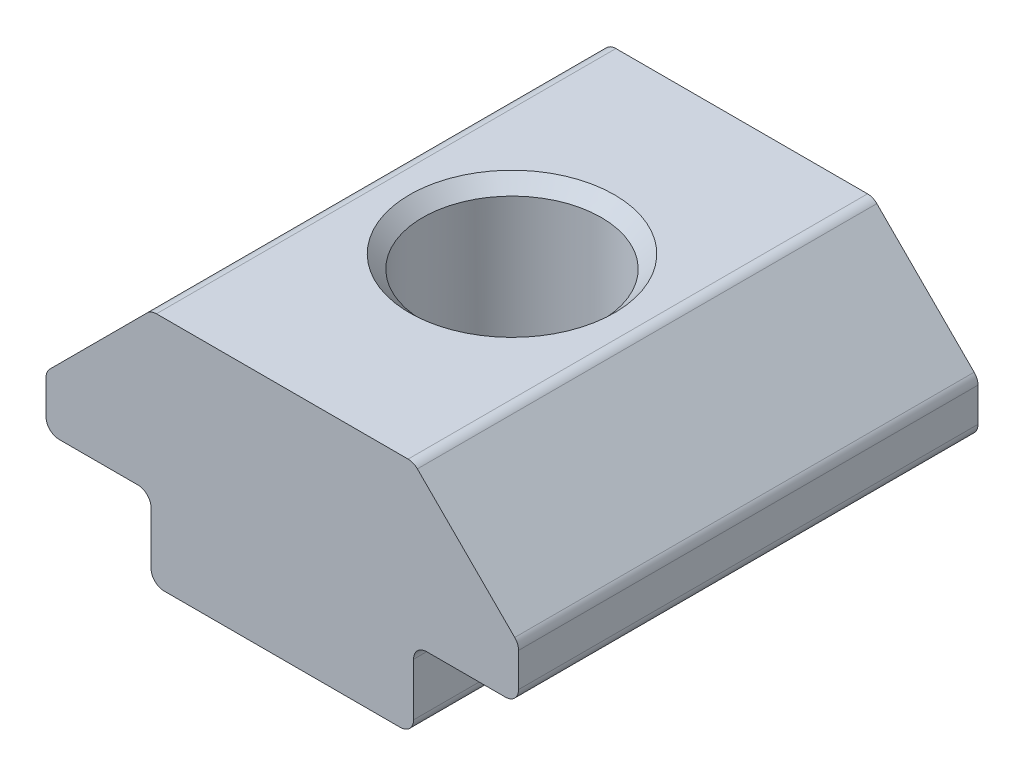
ISO-10303-21;
HEADER;
FILE_DESCRIPTION(('STEP AP214'),'2;1');
FILE_NAME('part.step','',(''),(''),'','','');
FILE_SCHEMA(('AUTOMOTIVE_DESIGN { 1 0 10303 214 1 1 1 1 }'));
ENDSEC;
DATA;
#1=APPLICATION_CONTEXT('core data for automotive mechanical design processes');
#2=APPLICATION_PROTOCOL_DEFINITION('international standard','automotive_design',2000,#1);
#3=PRODUCT_CONTEXT('',#1,'mechanical');
#4=PRODUCT('Part','Part','',(#3));
#5=PRODUCT_RELATED_PRODUCT_CATEGORY('part','',(#4));
#6=PRODUCT_DEFINITION_FORMATION('','',#4);
#7=PRODUCT_DEFINITION_CONTEXT('part definition',#1,'design');
#8=PRODUCT_DEFINITION('design','',#6,#7);
#9=PRODUCT_DEFINITION_SHAPE('','',#8);
#10=(LENGTH_UNIT() NAMED_UNIT(*) SI_UNIT(.MILLI.,.METRE.));
#11=(NAMED_UNIT(*) PLANE_ANGLE_UNIT() SI_UNIT($,.RADIAN.));
#12=(NAMED_UNIT(*) SI_UNIT($,.STERADIAN.) SOLID_ANGLE_UNIT());
#13=UNCERTAINTY_MEASURE_WITH_UNIT(LENGTH_MEASURE(1.E-05),#10,'distance_accuracy_value','');
#14=(GEOMETRIC_REPRESENTATION_CONTEXT(3) GLOBAL_UNCERTAINTY_ASSIGNED_CONTEXT((#13)) GLOBAL_UNIT_ASSIGNED_CONTEXT((#10,
#11,#12)) REPRESENTATION_CONTEXT('',''));
#15=CARTESIAN_POINT('',(0.,0.,0.));
#16=DIRECTION('',(0.,0.,1.));
#17=DIRECTION('',(1.,0.,0.));
#18=AXIS2_PLACEMENT_3D('',#15,#16,#17);
#19=CARTESIAN_POINT('',(-6.70675625884087,1.22965119205537,7.72754867549793));
#20=DIRECTION('',(1.,0.,0.));
#21=DIRECTION('',(0.,0.,-1.));
#22=AXIS2_PLACEMENT_3D('',#19,#20,#21);
#23=PLANE('',#22);
#24=DIRECTION('',(0.,-1.,0.));
#25=VECTOR('',#24,1.);
#26=CARTESIAN_POINT('',(-6.70675625884087,1.22965119205537,7.72754867549793));
#27=LINE('',#26,#25);
#28=CARTESIAN_POINT('',(-6.70675625884087,0.729651192055372,7.72754867549793));
#29=VERTEX_POINT('',#28);
#30=CARTESIAN_POINT('',(-6.70675625884087,-1.27034880794463,7.72754867549793));
#31=VERTEX_POINT('',#30);
#32=EDGE_CURVE('E204',#29,#31,#27,.T.);
#33=ORIENTED_EDGE('',*,*,#32,.F.);
#34=DIRECTION('',(0.,0.,-1.));
#35=VECTOR('',#34,1.);
#36=CARTESIAN_POINT('',(-6.70675625884087,0.729651192055372,-9.77245132450207));
#37=LINE('',#36,#35);
#38=CARTESIAN_POINT('',(-6.70675625884087,0.729651192055372,-9.77245132450207));
#39=VERTEX_POINT('',#38);
#40=EDGE_CURVE('E288',#29,#39,#37,.T.);
#41=ORIENTED_EDGE('',*,*,#40,.T.);
#42=DIRECTION('',(0.,-1.,0.));
#43=VECTOR('',#42,1.);
#44=CARTESIAN_POINT('',(-6.70675625884087,1.22965119205537,-9.77245132450207));
#45=LINE('',#44,#43);
#46=CARTESIAN_POINT('',(-6.70675625884087,-1.27034880794463,-9.77245132450207));
#47=VERTEX_POINT('',#46);
#48=EDGE_CURVE('E178',#39,#47,#45,.T.);
#49=ORIENTED_EDGE('',*,*,#48,.T.);
#50=DIRECTION('',(0.,0.,-1.));
#51=VECTOR('',#50,1.);
#52=CARTESIAN_POINT('',(-6.70675625884087,-1.27034880794463,7.72754867549793));
#53=LINE('',#52,#51);
#54=EDGE_CURVE('E160',#47,#31,#53,.F.);
#55=ORIENTED_EDGE('',*,*,#54,.T.);
#56=EDGE_LOOP('',(#33,#41,#49,#55));
#57=FACE_BOUND('',#56,.T.);
#58=ADVANCED_FACE('F16',(#57),#23,.F.);
#59=CARTESIAN_POINT('',(-6.70675625884087,-1.77034880794463,7.72754867549793));
#60=DIRECTION('',(0.,1.,0.));
#61=DIRECTION('',(0.,0.,1.));
#62=AXIS2_PLACEMENT_3D('',#59,#60,#61);
#63=PLANE('',#62);
#64=CARTESIAN_POINT('',(-1.70675625884087,-1.77034880794463,-1.02245132450207));
#65=DIRECTION('',(0.,1.,0.));
#66=DIRECTION('',(0.,0.,1.));
#67=AXIS2_PLACEMENT_3D('',#64,#65,#66);
#68=CIRCLE('',#67,3.9);
#69=CARTESIAN_POINT('',(-1.70675625884087,-1.77034880794463,2.87754867549793));
#70=VERTEX_POINT('',#69);
#71=EDGE_CURVE('E271',#70,#70,#68,.T.);
#72=ORIENTED_EDGE('',*,*,#71,.T.);
#73=EDGE_LOOP('',(#72));
#74=FACE_BOUND('',#73,.T.);
#75=DIRECTION('',(1.,0.,0.));
#76=VECTOR('',#75,1.);
#77=CARTESIAN_POINT('',(-6.70675625884087,-1.77034880794463,7.72754867549793));
#78=LINE('',#77,#76);
#79=CARTESIAN_POINT('',(-6.20675625884087,-1.77034880794463,7.72754867549793));
#80=VERTEX_POINT('',#79);
#81=CARTESIAN_POINT('',(2.79324374115913,-1.77034880794463,7.72754867549793));
#82=VERTEX_POINT('',#81);
#83=EDGE_CURVE('E171',#80,#82,#78,.T.);
#84=ORIENTED_EDGE('',*,*,#83,.F.);
#85=DIRECTION('',(0.,0.,-1.));
#86=VECTOR('',#85,1.);
#87=CARTESIAN_POINT('',(-6.20675625884087,-1.77034880794463,7.72754867549793));
#88=LINE('',#87,#86);
#89=CARTESIAN_POINT('',(-6.20675625884087,-1.77034880794463,-9.77245132450207));
#90=VERTEX_POINT('',#89);
#91=EDGE_CURVE('E158',#80,#90,#88,.T.);
#92=ORIENTED_EDGE('',*,*,#91,.T.);
#93=DIRECTION('',(1.,0.,0.));
#94=VECTOR('',#93,1.);
#95=CARTESIAN_POINT('',(-6.70675625884087,-1.77034880794463,-9.77245132450207));
#96=LINE('',#95,#94);
#97=CARTESIAN_POINT('',(2.79324374115913,-1.77034880794463,-9.77245132450207));
#98=VERTEX_POINT('',#97);
#99=EDGE_CURVE('E168',#90,#98,#96,.T.);
#100=ORIENTED_EDGE('',*,*,#99,.T.);
#101=DIRECTION('',(0.,0.,-1.));
#102=VECTOR('',#101,1.);
#103=CARTESIAN_POINT('',(2.79324374115913,-1.77034880794463,7.72754867549793));
#104=LINE('',#103,#102);
#105=EDGE_CURVE('E173',#98,#82,#104,.F.);
#106=ORIENTED_EDGE('',*,*,#105,.T.);
#107=EDGE_LOOP('',(#84,#92,#100,#106));
#108=FACE_BOUND('',#107,.T.);
#109=ADVANCED_FACE('F167',(#74,#108),#63,.F.);
#110=CARTESIAN_POINT('',(3.29324374115913,-1.77034880794463,7.72754867549793));
#111=DIRECTION('',(-1.,0.,0.));
#112=DIRECTION('',(0.,0.,1.));
#113=AXIS2_PLACEMENT_3D('',#110,#111,#112);
#114=PLANE('',#113);
#115=DIRECTION('',(0.,1.,0.));
#116=VECTOR('',#115,1.);
#117=CARTESIAN_POINT('',(3.29324374115913,-1.77034880794463,-9.77245132450207));
#118=LINE('',#117,#116);
#119=CARTESIAN_POINT('',(3.29324374115913,-1.27034880794463,-9.77245132450207));
#120=VERTEX_POINT('',#119);
#121=CARTESIAN_POINT('',(3.29324374115913,0.729651192055372,-9.77245132450207));
#122=VERTEX_POINT('',#121);
#123=EDGE_CURVE('E177',#120,#122,#118,.T.);
#124=ORIENTED_EDGE('',*,*,#123,.T.);
#125=DIRECTION('',(0.,0.,-1.));
#126=VECTOR('',#125,1.);
#127=CARTESIAN_POINT('',(3.29324374115913,0.729651192055372,7.72754867549793));
#128=LINE('',#127,#126);
#129=CARTESIAN_POINT('',(3.29324374115913,0.729651192055372,7.72754867549793));
#130=VERTEX_POINT('',#129);
#131=EDGE_CURVE('E286',#122,#130,#128,.F.);
#132=ORIENTED_EDGE('',*,*,#131,.T.);
#133=DIRECTION('',(0.,1.,0.));
#134=VECTOR('',#133,1.);
#135=CARTESIAN_POINT('',(3.29324374115913,-1.77034880794463,7.72754867549793));
#136=LINE('',#135,#134);
#137=CARTESIAN_POINT('',(3.29324374115913,-1.27034880794463,7.72754867549793));
#138=VERTEX_POINT('',#137);
#139=EDGE_CURVE('E302',#138,#130,#136,.T.);
#140=ORIENTED_EDGE('',*,*,#139,.F.);
#141=DIRECTION('',(0.,0.,-1.));
#142=VECTOR('',#141,1.);
#143=CARTESIAN_POINT('',(3.29324374115913,-1.27034880794463,7.72754867549793));
#144=LINE('',#143,#142);
#145=EDGE_CURVE('E268',#138,#120,#144,.T.);
#146=ORIENTED_EDGE('',*,*,#145,.T.);
#147=EDGE_LOOP('',(#124,#132,#140,#146));
#148=FACE_BOUND('',#147,.T.);
#149=ADVANCED_FACE('F315',(#148),#114,.F.);
#150=CARTESIAN_POINT('',(3.29324374115913,1.22965119205537,7.72754867549793));
#151=DIRECTION('',(0.,1.,0.));
#152=DIRECTION('',(0.,0.,1.));
#153=AXIS2_PLACEMENT_3D('',#150,#151,#152);
#154=PLANE('',#153);
#155=DIRECTION('',(1.,0.,0.));
#156=VECTOR('',#155,1.);
#157=CARTESIAN_POINT('',(3.29324374115913,1.22965119205537,7.72754867549793));
#158=LINE('',#157,#156);
#159=CARTESIAN_POINT('',(3.79324374115913,1.22965119205537,7.72754867549793));
#160=VERTEX_POINT('',#159);
#161=CARTESIAN_POINT('',(6.79324374115913,1.22965119205537,7.72754867549793));
#162=VERTEX_POINT('',#161);
#163=EDGE_CURVE('E300',#160,#162,#158,.T.);
#164=ORIENTED_EDGE('',*,*,#163,.F.);
#165=DIRECTION('',(0.,0.,-1.));
#166=VECTOR('',#165,1.);
#167=CARTESIAN_POINT('',(3.79324374115913,1.22965119205537,-9.77245132450207));
#168=LINE('',#167,#166);
#169=CARTESIAN_POINT('',(3.79324374115913,1.22965119205537,-9.77245132450207));
#170=VERTEX_POINT('',#169);
#171=EDGE_CURVE('E283',#160,#170,#168,.T.);
#172=ORIENTED_EDGE('',*,*,#171,.T.);
#173=DIRECTION('',(1.,0.,0.));
#174=VECTOR('',#173,1.);
#175=CARTESIAN_POINT('',(3.29324374115913,1.22965119205537,-9.77245132450207));
#176=LINE('',#175,#174);
#177=CARTESIAN_POINT('',(6.79324374115913,1.22965119205537,-9.77245132450207));
#178=VERTEX_POINT('',#177);
#179=EDGE_CURVE('E181',#170,#178,#176,.T.);
#180=ORIENTED_EDGE('',*,*,#179,.T.);
#181=DIRECTION('',(0.,0.,-1.));
#182=VECTOR('',#181,1.);
#183=CARTESIAN_POINT('',(6.79324374115913,1.22965119205537,7.72754867549793));
#184=LINE('',#183,#182);
#185=EDGE_CURVE('E265',#178,#162,#184,.F.);
#186=ORIENTED_EDGE('',*,*,#185,.T.);
#187=EDGE_LOOP('',(#164,#172,#180,#186));
#188=FACE_BOUND('',#187,.T.);
#189=ADVANCED_FACE('F307',(#188),#154,.F.);
#190=CARTESIAN_POINT('',(7.29324374115913,1.22965119205537,7.72754867549793));
#191=DIRECTION('',(-1.,0.,0.));
#192=DIRECTION('',(0.,0.,1.));
#193=AXIS2_PLACEMENT_3D('',#190,#191,#192);
#194=PLANE('',#193);
#195=DIRECTION('',(0.,1.,0.));
#196=VECTOR('',#195,1.);
#197=CARTESIAN_POINT('',(7.29324374115913,1.22965119205537,-9.77245132450207));
#198=LINE('',#197,#196);
#199=CARTESIAN_POINT('',(7.29324374115913,1.72965119205537,-9.77245132450207));
#200=VERTEX_POINT('',#199);
#201=CARTESIAN_POINT('',(7.29324374115913,3.02254441086884,-9.77245132450207));
#202=VERTEX_POINT('',#201);
#203=EDGE_CURVE('E187',#200,#202,#198,.T.);
#204=ORIENTED_EDGE('',*,*,#203,.T.);
#205=DIRECTION('',(0.,0.,-1.));
#206=VECTOR('',#205,1.);
#207=CARTESIAN_POINT('',(7.29324374115913,3.02254441086884,7.72754867549793));
#208=LINE('',#207,#206);
#209=CARTESIAN_POINT('',(7.29324374115913,3.02254441086884,7.72754867549793));
#210=VERTEX_POINT('',#209);
#211=EDGE_CURVE('E263',#202,#210,#208,.F.);
#212=ORIENTED_EDGE('',*,*,#211,.T.);
#213=DIRECTION('',(0.,1.,0.));
#214=VECTOR('',#213,1.);
#215=CARTESIAN_POINT('',(7.29324374115913,1.22965119205537,7.72754867549793));
#216=LINE('',#215,#214);
#217=CARTESIAN_POINT('',(7.29324374115913,1.72965119205537,7.72754867549793));
#218=VERTEX_POINT('',#217);
#219=EDGE_CURVE('E311',#218,#210,#216,.T.);
#220=ORIENTED_EDGE('',*,*,#219,.F.);
#221=DIRECTION('',(0.,0.,-1.));
#222=VECTOR('',#221,1.);
#223=CARTESIAN_POINT('',(7.29324374115913,1.72965119205537,7.72754867549793));
#224=LINE('',#223,#222);
#225=EDGE_CURVE('E260',#218,#200,#224,.T.);
#226=ORIENTED_EDGE('',*,*,#225,.T.);
#227=EDGE_LOOP('',(#204,#212,#220,#226));
#228=FACE_BOUND('',#227,.T.);
#229=ADVANCED_FACE('F541',(#228),#194,.F.);
#230=CARTESIAN_POINT('',(7.29324374115913,3.22965119205539,7.72754867549793));
#231=DIRECTION('',(-0.707106781186546,-0.707106781186549,0.));
#232=DIRECTION('',(0.707106781186549,-0.707106781186546,0.));
#233=AXIS2_PLACEMENT_3D('',#230,#231,#232);
#234=PLANE('',#233);
#235=DIRECTION('',(-0.707106781186549,0.707106781186546,0.));
#236=VECTOR('',#235,1.);
#237=CARTESIAN_POINT('',(7.29324374115913,3.22965119205539,-9.77245132450207));
#238=LINE('',#237,#236);
#239=CARTESIAN_POINT('',(7.1467971317524,3.37609780146211,-9.77245132450207));
#240=VERTEX_POINT('',#239);
#241=CARTESIAN_POINT('',(3.43969035056586,7.08320458264865,-9.77245132450207));
#242=VERTEX_POINT('',#241);
#243=EDGE_CURVE('E190',#240,#242,#238,.T.);
#244=ORIENTED_EDGE('',*,*,#243,.T.);
#245=DIRECTION('',(0.,0.,-1.));
#246=VECTOR('',#245,1.);
#247=CARTESIAN_POINT('',(3.43969035056586,7.08320458264864,7.72754867549793));
#248=LINE('',#247,#246);
#249=CARTESIAN_POINT('',(3.43969035056586,7.08320458264865,7.72754867549793));
#250=VERTEX_POINT('',#249);
#251=EDGE_CURVE('E258',#242,#250,#248,.F.);
#252=ORIENTED_EDGE('',*,*,#251,.T.);
#253=DIRECTION('',(-0.707106781186549,0.707106781186546,0.));
#254=VECTOR('',#253,1.);
#255=CARTESIAN_POINT('',(7.29324374115913,3.22965119205539,7.72754867549793));
#256=LINE('',#255,#254);
#257=CARTESIAN_POINT('',(7.1467971317524,3.37609780146211,7.72754867549793));
#258=VERTEX_POINT('',#257);
#259=EDGE_CURVE('E326',#258,#250,#256,.T.);
#260=ORIENTED_EDGE('',*,*,#259,.F.);
#261=DIRECTION('',(0.,0.,-1.));
#262=VECTOR('',#261,1.);
#263=CARTESIAN_POINT('',(7.1467971317524,3.37609780146211,7.72754867549793));
#264=LINE('',#263,#262);
#265=EDGE_CURVE('E255',#258,#240,#264,.T.);
#266=ORIENTED_EDGE('',*,*,#265,.T.);
#267=EDGE_LOOP('',(#244,#252,#260,#266));
#268=FACE_BOUND('',#267,.T.);
#269=ADVANCED_FACE('F531',(#268),#234,.F.);
#270=CARTESIAN_POINT('',(3.29324374115913,7.22965119205537,7.72754867549793));
#271=DIRECTION('',(0.,-1.,0.));
#272=DIRECTION('',(0.,0.,-1.));
#273=AXIS2_PLACEMENT_3D('',#270,#271,#272);
#274=PLANE('',#273);
#275=CARTESIAN_POINT('',(-1.70675625884087,7.22965119205537,-1.02245132450207));
#276=DIRECTION('',(0.,-1.,0.));
#277=DIRECTION('',(0.,0.,-1.));
#278=AXIS2_PLACEMENT_3D('',#275,#276,#277);
#279=CIRCLE('',#278,3.90000000000001);
#280=CARTESIAN_POINT('',(-1.70675625884087,7.22965119205537,-4.92245132450208));
#281=VERTEX_POINT('',#280);
#282=EDGE_CURVE('E280',#281,#281,#279,.T.);
#283=ORIENTED_EDGE('',*,*,#282,.T.);
#284=EDGE_LOOP('',(#283));
#285=FACE_BOUND('',#284,.T.);
#286=DIRECTION('',(-1.,0.,0.));
#287=VECTOR('',#286,1.);
#288=CARTESIAN_POINT('',(3.29324374115913,7.22965119205537,-9.77245132450207));
#289=LINE('',#288,#287);
#290=CARTESIAN_POINT('',(3.08613695997259,7.22965119205537,-9.77245132450207));
#291=VERTEX_POINT('',#290);
#292=CARTESIAN_POINT('',(-6.49964947765432,7.22965119205537,-9.77245132450207));
#293=VERTEX_POINT('',#292);
#294=EDGE_CURVE('E193',#291,#293,#289,.T.);
#295=ORIENTED_EDGE('',*,*,#294,.T.);
#296=DIRECTION('',(0.,0.,-1.));
#297=VECTOR('',#296,1.);
#298=CARTESIAN_POINT('',(-6.49964947765432,7.22965119205537,7.72754867549793));
#299=LINE('',#298,#297);
#300=CARTESIAN_POINT('',(-6.49964947765432,7.22965119205537,7.72754867549793));
#301=VERTEX_POINT('',#300);
#302=EDGE_CURVE('E253',#293,#301,#299,.F.);
#303=ORIENTED_EDGE('',*,*,#302,.T.);
#304=DIRECTION('',(-1.,0.,0.));
#305=VECTOR('',#304,1.);
#306=CARTESIAN_POINT('',(3.29324374115913,7.22965119205537,7.72754867549793));
#307=LINE('',#306,#305);
#308=CARTESIAN_POINT('',(3.08613695997259,7.22965119205537,7.72754867549793));
#309=VERTEX_POINT('',#308);
#310=EDGE_CURVE('E329',#309,#301,#307,.T.);
#311=ORIENTED_EDGE('',*,*,#310,.F.);
#312=DIRECTION('',(0.,0.,-1.));
#313=VECTOR('',#312,1.);
#314=CARTESIAN_POINT('',(3.08613695997259,7.22965119205537,7.72754867549793));
#315=LINE('',#314,#313);
#316=EDGE_CURVE('E250',#309,#291,#315,.T.);
#317=ORIENTED_EDGE('',*,*,#316,.T.);
#318=EDGE_LOOP('',(#295,#303,#311,#317));
#319=FACE_BOUND('',#318,.T.);
#320=ADVANCED_FACE('F521',(#285,#319),#274,.F.);
#321=CARTESIAN_POINT('',(-10.7067562588409,3.22965119205538,7.72754867549793));
#322=DIRECTION('',(0.707106781186546,-0.707106781186549,0.));
#323=DIRECTION('',(0.707106781186549,0.707106781186546,0.));
#324=AXIS2_PLACEMENT_3D('',#321,#322,#323);
#325=PLANE('',#324);
#326=DIRECTION('',(-0.707106781186549,-0.707106781186546,0.));
#327=VECTOR('',#326,1.);
#328=CARTESIAN_POINT('',(-10.7067562588409,3.22965119205538,-9.77245132450207));
#329=LINE('',#328,#327);
#330=CARTESIAN_POINT('',(-6.8532028682476,7.08320458264864,-9.77245132450207));
#331=VERTEX_POINT('',#330);
#332=CARTESIAN_POINT('',(-10.5603096494341,3.37609780146211,-9.77245132450207));
#333=VERTEX_POINT('',#332);
#334=EDGE_CURVE('E196',#331,#333,#329,.T.);
#335=ORIENTED_EDGE('',*,*,#334,.T.);
#336=DIRECTION('',(0.,0.,-1.));
#337=VECTOR('',#336,1.);
#338=CARTESIAN_POINT('',(-10.5603096494341,3.37609780146211,7.72754867549793));
#339=LINE('',#338,#337);
#340=CARTESIAN_POINT('',(-10.5603096494341,3.37609780146211,7.72754867549793));
#341=VERTEX_POINT('',#340);
#342=EDGE_CURVE('E248',#333,#341,#339,.F.);
#343=ORIENTED_EDGE('',*,*,#342,.T.);
#344=DIRECTION('',(-0.707106781186549,-0.707106781186546,0.));
#345=VECTOR('',#344,1.);
#346=CARTESIAN_POINT('',(-10.7067562588409,3.22965119205538,7.72754867549793));
#347=LINE('',#346,#345);
#348=CARTESIAN_POINT('',(-6.8532028682476,7.08320458264864,7.72754867549793));
#349=VERTEX_POINT('',#348);
#350=EDGE_CURVE('E332',#349,#341,#347,.T.);
#351=ORIENTED_EDGE('',*,*,#350,.F.);
#352=DIRECTION('',(0.,0.,-1.));
#353=VECTOR('',#352,1.);
#354=CARTESIAN_POINT('',(-6.8532028682476,7.08320458264864,7.72754867549793));
#355=LINE('',#354,#353);
#356=EDGE_CURVE('E245',#349,#331,#355,.T.);
#357=ORIENTED_EDGE('',*,*,#356,.T.);
#358=EDGE_LOOP('',(#335,#343,#351,#357));
#359=FACE_BOUND('',#358,.T.);
#360=ADVANCED_FACE('F511',(#359),#325,.F.);
#361=CARTESIAN_POINT('',(-10.7067562588409,1.22965119205537,7.72754867549793));
#362=DIRECTION('',(1.,0.,0.));
#363=DIRECTION('',(0.,0.,-1.));
#364=AXIS2_PLACEMENT_3D('',#361,#362,#363);
#365=PLANE('',#364);
#366=DIRECTION('',(0.,-1.,0.));
#367=VECTOR('',#366,1.);
#368=CARTESIAN_POINT('',(-10.7067562588409,1.22965119205537,-9.77245132450207));
#369=LINE('',#368,#367);
#370=CARTESIAN_POINT('',(-10.7067562588409,3.02254441086884,-9.77245132450207));
#371=VERTEX_POINT('',#370);
#372=CARTESIAN_POINT('',(-10.7067562588409,1.72965119205537,-9.77245132450207));
#373=VERTEX_POINT('',#372);
#374=EDGE_CURVE('E199',#371,#373,#369,.T.);
#375=ORIENTED_EDGE('',*,*,#374,.T.);
#376=DIRECTION('',(0.,0.,-1.));
#377=VECTOR('',#376,1.);
#378=CARTESIAN_POINT('',(-10.7067562588409,1.72965119205537,7.72754867549793));
#379=LINE('',#378,#377);
#380=CARTESIAN_POINT('',(-10.7067562588409,1.72965119205537,7.72754867549793));
#381=VERTEX_POINT('',#380);
#382=EDGE_CURVE('E243',#373,#381,#379,.F.);
#383=ORIENTED_EDGE('',*,*,#382,.T.);
#384=DIRECTION('',(0.,-1.,0.));
#385=VECTOR('',#384,1.);
#386=CARTESIAN_POINT('',(-10.7067562588409,1.22965119205537,7.72754867549793));
#387=LINE('',#386,#385);
#388=CARTESIAN_POINT('',(-10.7067562588409,3.02254441086884,7.72754867549793));
#389=VERTEX_POINT('',#388);
#390=EDGE_CURVE('E335',#389,#381,#387,.T.);
#391=ORIENTED_EDGE('',*,*,#390,.F.);
#392=DIRECTION('',(0.,0.,-1.));
#393=VECTOR('',#392,1.);
#394=CARTESIAN_POINT('',(-10.7067562588409,3.02254441086884,7.72754867549793));
#395=LINE('',#394,#393);
#396=EDGE_CURVE('E240',#389,#371,#395,.T.);
#397=ORIENTED_EDGE('',*,*,#396,.T.);
#398=EDGE_LOOP('',(#375,#383,#391,#397));
#399=FACE_BOUND('',#398,.T.);
#400=ADVANCED_FACE('F502',(#399),#365,.F.);
#401=CARTESIAN_POINT('',(-10.7067562588409,1.22965119205537,7.72754867549793));
#402=DIRECTION('',(0.,1.,0.));
#403=DIRECTION('',(0.,0.,1.));
#404=AXIS2_PLACEMENT_3D('',#401,#402,#403);
#405=PLANE('',#404);
#406=DIRECTION('',(1.,0.,0.));
#407=VECTOR('',#406,1.);
#408=CARTESIAN_POINT('',(-10.7067562588409,1.22965119205537,-9.77245132450207));
#409=LINE('',#408,#407);
#410=CARTESIAN_POINT('',(-10.2067562588409,1.22965119205537,-9.77245132450207));
#411=VERTEX_POINT('',#410);
#412=CARTESIAN_POINT('',(-7.20675625884087,1.22965119205537,-9.77245132450207));
#413=VERTEX_POINT('',#412);
#414=EDGE_CURVE('E202',#411,#413,#409,.T.);
#415=ORIENTED_EDGE('',*,*,#414,.T.);
#416=DIRECTION('',(0.,0.,-1.));
#417=VECTOR('',#416,1.);
#418=CARTESIAN_POINT('',(-7.20675625884087,1.22965119205537,7.72754867549793));
#419=LINE('',#418,#417);
#420=CARTESIAN_POINT('',(-7.20675625884087,1.22965119205537,7.72754867549793));
#421=VERTEX_POINT('',#420);
#422=EDGE_CURVE('E37',#413,#421,#419,.F.);
#423=ORIENTED_EDGE('',*,*,#422,.T.);
#424=DIRECTION('',(1.,0.,0.));
#425=VECTOR('',#424,1.);
#426=CARTESIAN_POINT('',(-10.7067562588409,1.22965119205537,7.72754867549793));
#427=LINE('',#426,#425);
#428=CARTESIAN_POINT('',(-10.2067562588409,1.22965119205537,7.72754867549793));
#429=VERTEX_POINT('',#428);
#430=EDGE_CURVE('E205',#429,#421,#427,.T.);
#431=ORIENTED_EDGE('',*,*,#430,.F.);
#432=DIRECTION('',(0.,0.,-1.));
#433=VECTOR('',#432,1.);
#434=CARTESIAN_POINT('',(-10.2067562588409,1.22965119205537,7.72754867549793));
#435=LINE('',#434,#433);
#436=EDGE_CURVE('E237',#429,#411,#435,.T.);
#437=ORIENTED_EDGE('',*,*,#436,.T.);
#438=EDGE_LOOP('',(#415,#423,#431,#437));
#439=FACE_BOUND('',#438,.T.);
#440=ADVANCED_FACE('F493',(#439),#405,.F.);
#441=CARTESIAN_POINT('',(-1.70675625884087,-1.77034880794463,7.72754867549793));
#442=DIRECTION('',(0.,0.,1.));
#443=DIRECTION('',(1.,0.,0.));
#444=AXIS2_PLACEMENT_3D('',#441,#442,#443);
#445=PLANE('',#444);
#446=ORIENTED_EDGE('',*,*,#430,.T.);
#447=CARTESIAN_POINT('',(-7.20675625884087,0.729651192055372,7.72754867549793));
#448=DIRECTION('',(0.,0.,1.));
#449=DIRECTION('',(1.,0.,0.));
#450=AXIS2_PLACEMENT_3D('',#447,#448,#449);
#451=CIRCLE('',#450,0.5);
#452=EDGE_CURVE('E10',#421,#29,#451,.F.);
#453=ORIENTED_EDGE('',*,*,#452,.T.);
#454=ORIENTED_EDGE('',*,*,#32,.T.);
#455=CARTESIAN_POINT('',(-6.20675625884087,-1.27034880794463,7.72754867549793));
#456=DIRECTION('',(0.,0.,1.));
#457=DIRECTION('',(1.,0.,0.));
#458=AXIS2_PLACEMENT_3D('',#455,#456,#457);
#459=CIRCLE('',#458,0.5);
#460=EDGE_CURVE('E235',#31,#80,#459,.T.);
#461=ORIENTED_EDGE('',*,*,#460,.T.);
#462=ORIENTED_EDGE('',*,*,#83,.T.);
#463=CARTESIAN_POINT('',(2.79324374115913,-1.27034880794463,7.72754867549793));
#464=DIRECTION('',(0.,0.,1.));
#465=DIRECTION('',(1.,0.,0.));
#466=AXIS2_PLACEMENT_3D('',#463,#464,#465);
#467=CIRCLE('',#466,0.5);
#468=EDGE_CURVE('E221',#82,#138,#467,.T.);
#469=ORIENTED_EDGE('',*,*,#468,.T.);
#470=ORIENTED_EDGE('',*,*,#139,.T.);
#471=CARTESIAN_POINT('',(3.79324374115913,0.729651192055372,7.72754867549793));
#472=DIRECTION('',(0.,0.,1.));
#473=DIRECTION('',(1.,0.,0.));
#474=AXIS2_PLACEMENT_3D('',#471,#472,#473);
#475=CIRCLE('',#474,0.5);
#476=EDGE_CURVE('E294',#130,#160,#475,.F.);
#477=ORIENTED_EDGE('',*,*,#476,.T.);
#478=ORIENTED_EDGE('',*,*,#163,.T.);
#479=CARTESIAN_POINT('',(6.79324374115913,1.72965119205537,7.72754867549793));
#480=DIRECTION('',(0.,0.,1.));
#481=DIRECTION('',(1.,0.,0.));
#482=AXIS2_PLACEMENT_3D('',#479,#480,#481);
#483=CIRCLE('',#482,0.5);
#484=EDGE_CURVE('E223',#162,#218,#483,.T.);
#485=ORIENTED_EDGE('',*,*,#484,.T.);
#486=ORIENTED_EDGE('',*,*,#219,.T.);
#487=CARTESIAN_POINT('',(6.79324374115913,3.02254441086884,7.72754867549793));
#488=DIRECTION('',(0.,0.,1.));
#489=DIRECTION('',(1.,0.,0.));
#490=AXIS2_PLACEMENT_3D('',#487,#488,#489);
#491=CIRCLE('',#490,0.5);
#492=EDGE_CURVE('E225',#210,#258,#491,.T.);
#493=ORIENTED_EDGE('',*,*,#492,.T.);
#494=ORIENTED_EDGE('',*,*,#259,.T.);
#495=CARTESIAN_POINT('',(3.08613695997259,6.72965119205537,7.72754867549793));
#496=DIRECTION('',(0.,0.,1.));
#497=DIRECTION('',(1.,0.,0.));
#498=AXIS2_PLACEMENT_3D('',#495,#496,#497);
#499=CIRCLE('',#498,0.5);
#500=EDGE_CURVE('E227',#250,#309,#499,.T.);
#501=ORIENTED_EDGE('',*,*,#500,.T.);
#502=ORIENTED_EDGE('',*,*,#310,.T.);
#503=CARTESIAN_POINT('',(-6.49964947765432,6.72965119205537,7.72754867549793));
#504=DIRECTION('',(0.,0.,1.));
#505=DIRECTION('',(1.,0.,0.));
#506=AXIS2_PLACEMENT_3D('',#503,#504,#505);
#507=CIRCLE('',#506,0.5);
#508=EDGE_CURVE('E229',#301,#349,#507,.T.);
#509=ORIENTED_EDGE('',*,*,#508,.T.);
#510=ORIENTED_EDGE('',*,*,#350,.T.);
#511=CARTESIAN_POINT('',(-10.2067562588409,3.02254441086884,7.72754867549793));
#512=DIRECTION('',(0.,0.,1.));
#513=DIRECTION('',(1.,0.,0.));
#514=AXIS2_PLACEMENT_3D('',#511,#512,#513);
#515=CIRCLE('',#514,0.5);
#516=EDGE_CURVE('E231',#341,#389,#515,.T.);
#517=ORIENTED_EDGE('',*,*,#516,.T.);
#518=ORIENTED_EDGE('',*,*,#390,.T.);
#519=CARTESIAN_POINT('',(-10.2067562588409,1.72965119205537,7.72754867549793));
#520=DIRECTION('',(0.,0.,1.));
#521=DIRECTION('',(1.,0.,0.));
#522=AXIS2_PLACEMENT_3D('',#519,#520,#521);
#523=CIRCLE('',#522,0.5);
#524=EDGE_CURVE('E233',#381,#429,#523,.T.);
#525=ORIENTED_EDGE('',*,*,#524,.T.);
#526=EDGE_LOOP('',(#446,#453,#454,#461,#462,#469,#470,#477,#478,#485,#486,#493,#494,#501,#502,
#509,#510,#517,#518,#525));
#527=FACE_BOUND('',#526,.T.);
#528=ADVANCED_FACE('F299',(#527),#445,.T.);
#529=CARTESIAN_POINT('',(-1.70675625884087,-1.77034880794463,-9.77245132450207));
#530=DIRECTION('',(0.,0.,1.));
#531=DIRECTION('',(1.,0.,0.));
#532=AXIS2_PLACEMENT_3D('',#529,#530,#531);
#533=PLANE('',#532);
#534=ORIENTED_EDGE('',*,*,#99,.F.);
#535=CARTESIAN_POINT('',(-6.20675625884087,-1.27034880794463,-9.77245132450207));
#536=DIRECTION('',(0.,0.,1.));
#537=DIRECTION('',(1.,0.,0.));
#538=AXIS2_PLACEMENT_3D('',#535,#536,#537);
#539=CIRCLE('',#538,0.5);
#540=EDGE_CURVE('E154',#90,#47,#539,.F.);
#541=ORIENTED_EDGE('',*,*,#540,.T.);
#542=ORIENTED_EDGE('',*,*,#48,.F.);
#543=CARTESIAN_POINT('',(-7.20675625884087,0.729651192055372,-9.77245132450207));
#544=DIRECTION('',(0.,0.,1.));
#545=DIRECTION('',(1.,0.,0.));
#546=AXIS2_PLACEMENT_3D('',#543,#544,#545);
#547=CIRCLE('',#546,0.5);
#548=EDGE_CURVE('E24',#39,#413,#547,.T.);
#549=ORIENTED_EDGE('',*,*,#548,.T.);
#550=ORIENTED_EDGE('',*,*,#414,.F.);
#551=CARTESIAN_POINT('',(-10.2067562588409,1.72965119205537,-9.77245132450207));
#552=DIRECTION('',(0.,0.,1.));
#553=DIRECTION('',(1.,0.,0.));
#554=AXIS2_PLACEMENT_3D('',#551,#552,#553);
#555=CIRCLE('',#554,0.5);
#556=EDGE_CURVE('E162',#411,#373,#555,.F.);
#557=ORIENTED_EDGE('',*,*,#556,.T.);
#558=ORIENTED_EDGE('',*,*,#374,.F.);
#559=CARTESIAN_POINT('',(-10.2067562588409,3.02254441086884,-9.77245132450207));
#560=DIRECTION('',(0.,0.,1.));
#561=DIRECTION('',(1.,0.,0.));
#562=AXIS2_PLACEMENT_3D('',#559,#560,#561);
#563=CIRCLE('',#562,0.5);
#564=EDGE_CURVE('E217',#371,#333,#563,.F.);
#565=ORIENTED_EDGE('',*,*,#564,.T.);
#566=ORIENTED_EDGE('',*,*,#334,.F.);
#567=CARTESIAN_POINT('',(-6.49964947765432,6.72965119205537,-9.77245132450207));
#568=DIRECTION('',(0.,0.,1.));
#569=DIRECTION('',(1.,0.,0.));
#570=AXIS2_PLACEMENT_3D('',#567,#568,#569);
#571=CIRCLE('',#570,0.5);
#572=EDGE_CURVE('E215',#331,#293,#571,.F.);
#573=ORIENTED_EDGE('',*,*,#572,.T.);
#574=ORIENTED_EDGE('',*,*,#294,.F.);
#575=CARTESIAN_POINT('',(3.08613695997259,6.72965119205537,-9.77245132450207));
#576=DIRECTION('',(0.,0.,1.));
#577=DIRECTION('',(1.,0.,0.));
#578=AXIS2_PLACEMENT_3D('',#575,#576,#577);
#579=CIRCLE('',#578,0.5);
#580=EDGE_CURVE('E213',#291,#242,#579,.F.);
#581=ORIENTED_EDGE('',*,*,#580,.T.);
#582=ORIENTED_EDGE('',*,*,#243,.F.);
#583=CARTESIAN_POINT('',(6.79324374115913,3.02254441086884,-9.77245132450207));
#584=DIRECTION('',(0.,0.,1.));
#585=DIRECTION('',(1.,0.,0.));
#586=AXIS2_PLACEMENT_3D('',#583,#584,#585);
#587=CIRCLE('',#586,0.5);
#588=EDGE_CURVE('E211',#240,#202,#587,.F.);
#589=ORIENTED_EDGE('',*,*,#588,.T.);
#590=ORIENTED_EDGE('',*,*,#203,.F.);
#591=CARTESIAN_POINT('',(6.79324374115913,1.72965119205537,-9.77245132450207));
#592=DIRECTION('',(0.,0.,1.));
#593=DIRECTION('',(1.,0.,0.));
#594=AXIS2_PLACEMENT_3D('',#591,#592,#593);
#595=CIRCLE('',#594,0.5);
#596=EDGE_CURVE('E208',#200,#178,#595,.F.);
#597=ORIENTED_EDGE('',*,*,#596,.T.);
#598=ORIENTED_EDGE('',*,*,#179,.F.);
#599=CARTESIAN_POINT('',(3.79324374115913,0.729651192055372,-9.77245132450207));
#600=DIRECTION('',(0.,0.,1.));
#601=DIRECTION('',(1.,0.,0.));
#602=AXIS2_PLACEMENT_3D('',#599,#600,#601);
#603=CIRCLE('',#602,0.5);
#604=EDGE_CURVE('E292',#170,#122,#603,.T.);
#605=ORIENTED_EDGE('',*,*,#604,.T.);
#606=ORIENTED_EDGE('',*,*,#123,.F.);
#607=CARTESIAN_POINT('',(2.79324374115913,-1.27034880794463,-9.77245132450207));
#608=DIRECTION('',(0.,0.,1.));
#609=DIRECTION('',(1.,0.,0.));
#610=AXIS2_PLACEMENT_3D('',#607,#608,#609);
#611=CIRCLE('',#610,0.5);
#612=EDGE_CURVE('E172',#120,#98,#611,.F.);
#613=ORIENTED_EDGE('',*,*,#612,.T.);
#614=EDGE_LOOP('',(#534,#541,#542,#549,#550,#557,#558,#565,#566,#573,#574,#581,#582,#589,#590,
#597,#598,#605,#606,#613));
#615=FACE_BOUND('',#614,.T.);
#616=ADVANCED_FACE('F175',(#615),#533,.F.);
#617=CARTESIAN_POINT('',(-6.20675625884087,-1.27034880794463,7.72754867549793));
#618=DIRECTION('',(0.,0.,-1.));
#619=DIRECTION('',(-1.,0.,0.));
#620=AXIS2_PLACEMENT_3D('',#617,#618,#619);
#621=CYLINDRICAL_SURFACE('',#620,0.5);
#622=ORIENTED_EDGE('',*,*,#460,.F.);
#623=ORIENTED_EDGE('',*,*,#54,.F.);
#624=ORIENTED_EDGE('',*,*,#540,.F.);
#625=ORIENTED_EDGE('',*,*,#91,.F.);
#626=EDGE_LOOP('',(#622,#623,#624,#625));
#627=FACE_BOUND('',#626,.T.);
#628=ADVANCED_FACE('F157',(#627),#621,.T.);
#629=CARTESIAN_POINT('',(-10.2067562588409,1.72965119205537,7.72754867549793));
#630=DIRECTION('',(0.,0.,-1.));
#631=DIRECTION('',(-1.,0.,0.));
#632=AXIS2_PLACEMENT_3D('',#629,#630,#631);
#633=CYLINDRICAL_SURFACE('',#632,0.5);
#634=ORIENTED_EDGE('',*,*,#524,.F.);
#635=ORIENTED_EDGE('',*,*,#382,.F.);
#636=ORIENTED_EDGE('',*,*,#556,.F.);
#637=ORIENTED_EDGE('',*,*,#436,.F.);
#638=EDGE_LOOP('',(#634,#635,#636,#637));
#639=FACE_BOUND('',#638,.T.);
#640=ADVANCED_FACE('F356',(#639),#633,.T.);
#641=CARTESIAN_POINT('',(-10.2067562588409,3.02254441086884,7.72754867549793));
#642=DIRECTION('',(0.,0.,-1.));
#643=DIRECTION('',(-1.,0.,0.));
#644=AXIS2_PLACEMENT_3D('',#641,#642,#643);
#645=CYLINDRICAL_SURFACE('',#644,0.5);
#646=ORIENTED_EDGE('',*,*,#516,.F.);
#647=ORIENTED_EDGE('',*,*,#342,.F.);
#648=ORIENTED_EDGE('',*,*,#564,.F.);
#649=ORIENTED_EDGE('',*,*,#396,.F.);
#650=EDGE_LOOP('',(#646,#647,#648,#649));
#651=FACE_BOUND('',#650,.T.);
#652=ADVANCED_FACE('F359',(#651),#645,.T.);
#653=CARTESIAN_POINT('',(-6.49964947765432,6.72965119205537,7.72754867549793));
#654=DIRECTION('',(0.,0.,-1.));
#655=DIRECTION('',(-1.,0.,0.));
#656=AXIS2_PLACEMENT_3D('',#653,#654,#655);
#657=CYLINDRICAL_SURFACE('',#656,0.5);
#658=ORIENTED_EDGE('',*,*,#508,.F.);
#659=ORIENTED_EDGE('',*,*,#302,.F.);
#660=ORIENTED_EDGE('',*,*,#572,.F.);
#661=ORIENTED_EDGE('',*,*,#356,.F.);
#662=EDGE_LOOP('',(#658,#659,#660,#661));
#663=FACE_BOUND('',#662,.T.);
#664=ADVANCED_FACE('F363',(#663),#657,.T.);
#665=CARTESIAN_POINT('',(3.08613695997259,6.72965119205537,7.72754867549793));
#666=DIRECTION('',(0.,0.,-1.));
#667=DIRECTION('',(-1.,0.,0.));
#668=AXIS2_PLACEMENT_3D('',#665,#666,#667);
#669=CYLINDRICAL_SURFACE('',#668,0.5);
#670=ORIENTED_EDGE('',*,*,#500,.F.);
#671=ORIENTED_EDGE('',*,*,#251,.F.);
#672=ORIENTED_EDGE('',*,*,#580,.F.);
#673=ORIENTED_EDGE('',*,*,#316,.F.);
#674=EDGE_LOOP('',(#670,#671,#672,#673));
#675=FACE_BOUND('',#674,.T.);
#676=ADVANCED_FACE('F367',(#675),#669,.T.);
#677=CARTESIAN_POINT('',(6.79324374115913,3.02254441086884,7.72754867549793));
#678=DIRECTION('',(0.,0.,-1.));
#679=DIRECTION('',(-1.,0.,0.));
#680=AXIS2_PLACEMENT_3D('',#677,#678,#679);
#681=CYLINDRICAL_SURFACE('',#680,0.5);
#682=ORIENTED_EDGE('',*,*,#492,.F.);
#683=ORIENTED_EDGE('',*,*,#211,.F.);
#684=ORIENTED_EDGE('',*,*,#588,.F.);
#685=ORIENTED_EDGE('',*,*,#265,.F.);
#686=EDGE_LOOP('',(#682,#683,#684,#685));
#687=FACE_BOUND('',#686,.T.);
#688=ADVANCED_FACE('F371',(#687),#681,.T.);
#689=CARTESIAN_POINT('',(6.79324374115913,1.72965119205537,7.72754867549793));
#690=DIRECTION('',(0.,0.,-1.));
#691=DIRECTION('',(-1.,0.,0.));
#692=AXIS2_PLACEMENT_3D('',#689,#690,#691);
#693=CYLINDRICAL_SURFACE('',#692,0.5);
#694=ORIENTED_EDGE('',*,*,#484,.F.);
#695=ORIENTED_EDGE('',*,*,#185,.F.);
#696=ORIENTED_EDGE('',*,*,#596,.F.);
#697=ORIENTED_EDGE('',*,*,#225,.F.);
#698=EDGE_LOOP('',(#694,#695,#696,#697));
#699=FACE_BOUND('',#698,.T.);
#700=ADVANCED_FACE('F375',(#699),#693,.T.);
#701=CARTESIAN_POINT('',(2.79324374115913,-1.27034880794463,7.72754867549793));
#702=DIRECTION('',(0.,0.,-1.));
#703=DIRECTION('',(-1.,0.,0.));
#704=AXIS2_PLACEMENT_3D('',#701,#702,#703);
#705=CYLINDRICAL_SURFACE('',#704,0.5);
#706=ORIENTED_EDGE('',*,*,#468,.F.);
#707=ORIENTED_EDGE('',*,*,#105,.F.);
#708=ORIENTED_EDGE('',*,*,#612,.F.);
#709=ORIENTED_EDGE('',*,*,#145,.F.);
#710=EDGE_LOOP('',(#706,#707,#708,#709));
#711=FACE_BOUND('',#710,.T.);
#712=ADVANCED_FACE('F319',(#711),#705,.T.);
#713=CARTESIAN_POINT('',(-1.70675625884087,-1.77034880794463,-1.02245132450207));
#714=DIRECTION('',(0.,1.,0.));
#715=DIRECTION('',(0.,0.,1.));
#716=AXIS2_PLACEMENT_3D('',#713,#714,#715);
#717=CYLINDRICAL_SURFACE('',#716,3.4);
#718=CARTESIAN_POINT('',(-1.70675625884087,-1.27034880794462,-1.02245132450207));
#719=DIRECTION('',(0.,1.,0.));
#720=DIRECTION('',(0.,0.,1.));
#721=AXIS2_PLACEMENT_3D('',#718,#719,#720);
#722=CIRCLE('',#721,3.4);
#723=CARTESIAN_POINT('',(-1.70675625884087,-1.27034880794462,2.37754867549793));
#724=VERTEX_POINT('',#723);
#725=EDGE_CURVE('E277',#724,#724,#722,.F.);
#726=ORIENTED_EDGE('',*,*,#725,.T.);
#727=EDGE_LOOP('',(#726));
#728=FACE_BOUND('',#727,.T.);
#729=CARTESIAN_POINT('',(-1.70675625884087,6.72965119205536,-1.02245132450207));
#730=DIRECTION('',(0.,-1.,0.));
#731=DIRECTION('',(0.,0.,-1.));
#732=AXIS2_PLACEMENT_3D('',#729,#730,#731);
#733=CIRCLE('',#732,3.4);
#734=CARTESIAN_POINT('',(-1.70675625884087,6.72965119205536,-4.42245132450207));
#735=VERTEX_POINT('',#734);
#736=EDGE_CURVE('E274',#735,#735,#733,.F.);
#737=ORIENTED_EDGE('',*,*,#736,.T.);
#738=EDGE_LOOP('',(#737));
#739=FACE_BOUND('',#738,.T.);
#740=ADVANCED_FACE('F382',(#728,#739),#717,.F.);
#741=CARTESIAN_POINT('',(-1.70675625884087,-1.77034880794463,-1.02245132450207));
#742=DIRECTION('',(0.,-1.,0.));
#743=DIRECTION('',(0.,0.,-1.));
#744=AXIS2_PLACEMENT_3D('',#741,#742,#743);
#745=CONICAL_SURFACE('',#744,3.9,0.785398163397448);
#746=ORIENTED_EDGE('',*,*,#725,.F.);
#747=EDGE_LOOP('',(#746));
#748=FACE_BOUND('',#747,.T.);
#749=ORIENTED_EDGE('',*,*,#71,.F.);
#750=EDGE_LOOP('',(#749));
#751=FACE_BOUND('',#750,.T.);
#752=ADVANCED_FACE('F383',(#748,#751),#745,.F.);
#753=CARTESIAN_POINT('',(-1.70675625884087,6.72965119205536,-1.02245132450207));
#754=DIRECTION('',(0.,1.,0.));
#755=DIRECTION('',(0.,0.,1.));
#756=AXIS2_PLACEMENT_3D('',#753,#754,#755);
#757=CONICAL_SURFACE('',#756,3.4,0.78539816339745);
#758=ORIENTED_EDGE('',*,*,#282,.F.);
#759=EDGE_LOOP('',(#758));
#760=FACE_BOUND('',#759,.T.);
#761=ORIENTED_EDGE('',*,*,#736,.F.);
#762=EDGE_LOOP('',(#761));
#763=FACE_BOUND('',#762,.T.);
#764=ADVANCED_FACE('F386',(#760,#763),#757,.F.);
#765=CARTESIAN_POINT('',(3.79324374115913,0.729651192055372,7.72754867549793));
#766=DIRECTION('',(0.,0.,1.));
#767=DIRECTION('',(1.,0.,0.));
#768=AXIS2_PLACEMENT_3D('',#765,#766,#767);
#769=CYLINDRICAL_SURFACE('',#768,0.5);
#770=ORIENTED_EDGE('',*,*,#476,.F.);
#771=ORIENTED_EDGE('',*,*,#131,.F.);
#772=ORIENTED_EDGE('',*,*,#604,.F.);
#773=ORIENTED_EDGE('',*,*,#171,.F.);
#774=EDGE_LOOP('',(#770,#771,#772,#773));
#775=FACE_BOUND('',#774,.T.);
#776=ADVANCED_FACE('F313',(#775),#769,.F.);
#777=CARTESIAN_POINT('',(-7.20675625884087,0.729651192055372,7.72754867549793));
#778=DIRECTION('',(0.,0.,1.));
#779=DIRECTION('',(1.,0.,0.));
#780=AXIS2_PLACEMENT_3D('',#777,#778,#779);
#781=CYLINDRICAL_SURFACE('',#780,0.5);
#782=ORIENTED_EDGE('',*,*,#452,.F.);
#783=ORIENTED_EDGE('',*,*,#422,.F.);
#784=ORIENTED_EDGE('',*,*,#548,.F.);
#785=ORIENTED_EDGE('',*,*,#40,.F.);
#786=EDGE_LOOP('',(#782,#783,#784,#785));
#787=FACE_BOUND('',#786,.T.);
#788=ADVANCED_FACE('F18',(#787),#781,.F.);
#789=CLOSED_SHELL('',(#58,#109,#149,#189,#229,#269,#320,#360,#400,#440,#528,#616,#628,#640,#652,
#664,#676,#688,#700,#712,#740,#752,#764,#776,#788));
#790=MANIFOLD_SOLID_BREP('B1',#789);
#791=ADVANCED_BREP_SHAPE_REPRESENTATION('',(#18,#790),#14);
#792=SHAPE_DEFINITION_REPRESENTATION(#9,#791);
ENDSEC;
END-ISO-10303-21;
